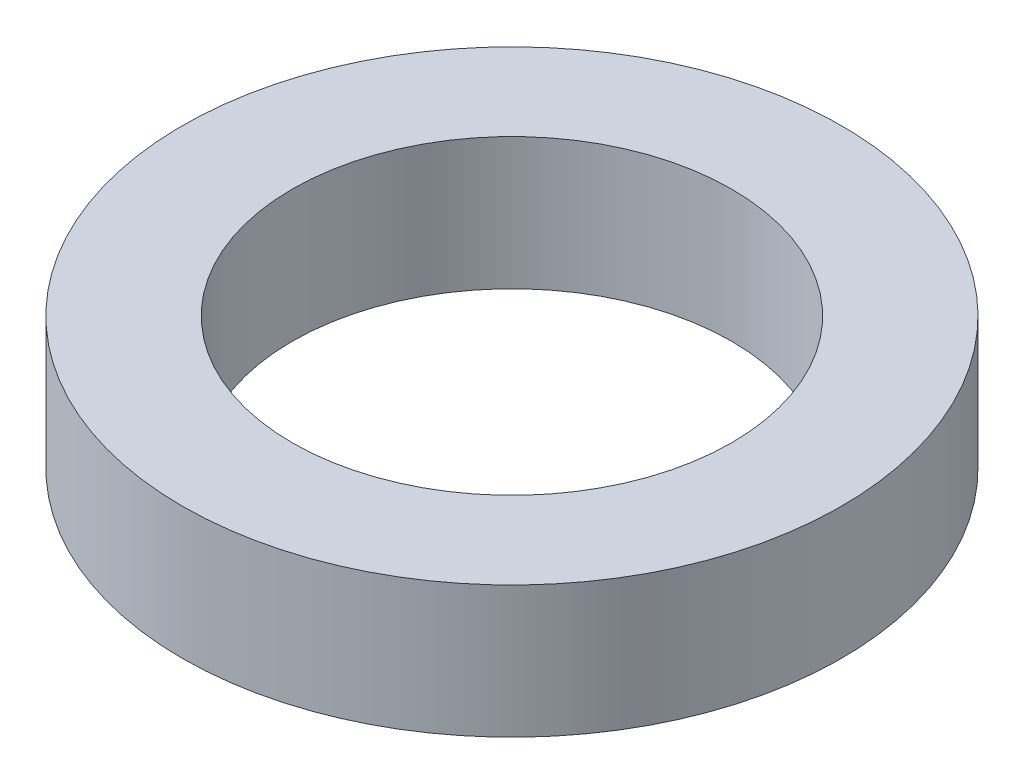
ISO-10303-21;
HEADER;
FILE_DESCRIPTION(('STEP AP214'),'2;1');
FILE_NAME('part.step','',(''),(''),'','','');
FILE_SCHEMA(('AUTOMOTIVE_DESIGN { 1 0 10303 214 1 1 1 1 }'));
ENDSEC;
DATA;
#1=APPLICATION_CONTEXT('core data for automotive mechanical design processes');
#2=APPLICATION_PROTOCOL_DEFINITION('international standard','automotive_design',2000,#1);
#3=PRODUCT_CONTEXT('',#1,'mechanical');
#4=PRODUCT('Part','Part','',(#3));
#5=PRODUCT_RELATED_PRODUCT_CATEGORY('part','',(#4));
#6=PRODUCT_DEFINITION_FORMATION('','',#4);
#7=PRODUCT_DEFINITION_CONTEXT('part definition',#1,'design');
#8=PRODUCT_DEFINITION('design','',#6,#7);
#9=PRODUCT_DEFINITION_SHAPE('','',#8);
#10=(LENGTH_UNIT() NAMED_UNIT(*) SI_UNIT(.MILLI.,.METRE.));
#11=(NAMED_UNIT(*) PLANE_ANGLE_UNIT() SI_UNIT($,.RADIAN.));
#12=(NAMED_UNIT(*) SI_UNIT($,.STERADIAN.) SOLID_ANGLE_UNIT());
#13=UNCERTAINTY_MEASURE_WITH_UNIT(LENGTH_MEASURE(1.E-05),#10,'distance_accuracy_value','');
#14=(GEOMETRIC_REPRESENTATION_CONTEXT(3) GLOBAL_UNCERTAINTY_ASSIGNED_CONTEXT((#13)) GLOBAL_UNIT_ASSIGNED_CONTEXT((#10,
#11,#12)) REPRESENTATION_CONTEXT('',''));
#15=CARTESIAN_POINT('',(0.,0.,0.));
#16=DIRECTION('',(0.,0.,1.));
#17=DIRECTION('',(1.,0.,0.));
#18=AXIS2_PLACEMENT_3D('',#15,#16,#17);
#19=CARTESIAN_POINT('',(0.,30.,0.));
#20=DIRECTION('',(0.,-1.,0.));
#21=DIRECTION('',(0.,0.,-1.));
#22=AXIS2_PLACEMENT_3D('',#19,#20,#21);
#23=CYLINDRICAL_SURFACE('',#22,75.);
#24=CARTESIAN_POINT('',(0.,30.,0.));
#25=DIRECTION('',(0.,1.,0.));
#26=DIRECTION('',(0.,0.,1.));
#27=AXIS2_PLACEMENT_3D('',#24,#25,#26);
#28=CIRCLE('',#27,75.);
#29=CARTESIAN_POINT('',(0.,30.,75.));
#30=VERTEX_POINT('',#29);
#31=EDGE_CURVE('E10',#30,#30,#28,.T.);
#32=ORIENTED_EDGE('',*,*,#31,.F.);
#33=EDGE_LOOP('',(#32));
#34=FACE_BOUND('',#33,.T.);
#35=CARTESIAN_POINT('',(0.,0.,0.));
#36=DIRECTION('',(0.,1.,0.));
#37=DIRECTION('',(0.,0.,1.));
#38=AXIS2_PLACEMENT_3D('',#35,#36,#37);
#39=CIRCLE('',#38,75.);
#40=CARTESIAN_POINT('',(0.,0.,75.));
#41=VERTEX_POINT('',#40);
#42=EDGE_CURVE('E37',#41,#41,#39,.T.);
#43=ORIENTED_EDGE('',*,*,#42,.T.);
#44=EDGE_LOOP('',(#43));
#45=FACE_BOUND('',#44,.T.);
#46=ADVANCED_FACE('F40',(#34,#45),#23,.T.);
#47=CARTESIAN_POINT('',(0.,30.,0.));
#48=DIRECTION('',(0.,1.,0.));
#49=DIRECTION('',(0.,0.,1.));
#50=AXIS2_PLACEMENT_3D('',#47,#48,#49);
#51=PLANE('',#50);
#52=CARTESIAN_POINT('',(0.,30.,0.));
#53=DIRECTION('',(0.,1.,0.));
#54=DIRECTION('',(0.,0.,1.));
#55=AXIS2_PLACEMENT_3D('',#52,#53,#54);
#56=CIRCLE('',#55,50.);
#57=CARTESIAN_POINT('',(0.,30.,50.));
#58=VERTEX_POINT('',#57);
#59=EDGE_CURVE('E50',#58,#58,#56,.T.);
#60=ORIENTED_EDGE('',*,*,#59,.F.);
#61=EDGE_LOOP('',(#60));
#62=FACE_BOUND('',#61,.T.);
#63=ORIENTED_EDGE('',*,*,#31,.T.);
#64=EDGE_LOOP('',(#63));
#65=FACE_BOUND('',#64,.T.);
#66=ADVANCED_FACE('F59',(#62,#65),#51,.T.);
#67=CARTESIAN_POINT('',(0.,0.,0.));
#68=DIRECTION('',(0.,1.,0.));
#69=DIRECTION('',(0.,0.,1.));
#70=AXIS2_PLACEMENT_3D('',#67,#68,#69);
#71=PLANE('',#70);
#72=CARTESIAN_POINT('',(0.,0.,0.));
#73=DIRECTION('',(0.,1.,0.));
#74=DIRECTION('',(0.,0.,1.));
#75=AXIS2_PLACEMENT_3D('',#72,#73,#74);
#76=CIRCLE('',#75,50.);
#77=CARTESIAN_POINT('',(0.,0.,50.));
#78=VERTEX_POINT('',#77);
#79=EDGE_CURVE('E47',#78,#78,#76,.T.);
#80=ORIENTED_EDGE('',*,*,#79,.T.);
#81=EDGE_LOOP('',(#80));
#82=FACE_BOUND('',#81,.T.);
#83=ORIENTED_EDGE('',*,*,#42,.F.);
#84=EDGE_LOOP('',(#83));
#85=FACE_BOUND('',#84,.T.);
#86=ADVANCED_FACE('F58',(#82,#85),#71,.F.);
#87=CARTESIAN_POINT('',(0.,30.,0.));
#88=DIRECTION('',(0.,-1.,0.));
#89=DIRECTION('',(0.,0.,-1.));
#90=AXIS2_PLACEMENT_3D('',#87,#88,#89);
#91=CYLINDRICAL_SURFACE('',#90,50.);
#92=ORIENTED_EDGE('',*,*,#59,.T.);
#93=EDGE_LOOP('',(#92));
#94=FACE_BOUND('',#93,.T.);
#95=ORIENTED_EDGE('',*,*,#79,.F.);
#96=EDGE_LOOP('',(#95));
#97=FACE_BOUND('',#96,.T.);
#98=ADVANCED_FACE('F54',(#94,#97),#91,.F.);
#99=CLOSED_SHELL('',(#46,#66,#86,#98));
#100=MANIFOLD_SOLID_BREP('B2',#99);
#101=ADVANCED_BREP_SHAPE_REPRESENTATION('',(#18,#100),#14);
#102=SHAPE_DEFINITION_REPRESENTATION(#9,#101);
ENDSEC;
END-ISO-10303-21;
